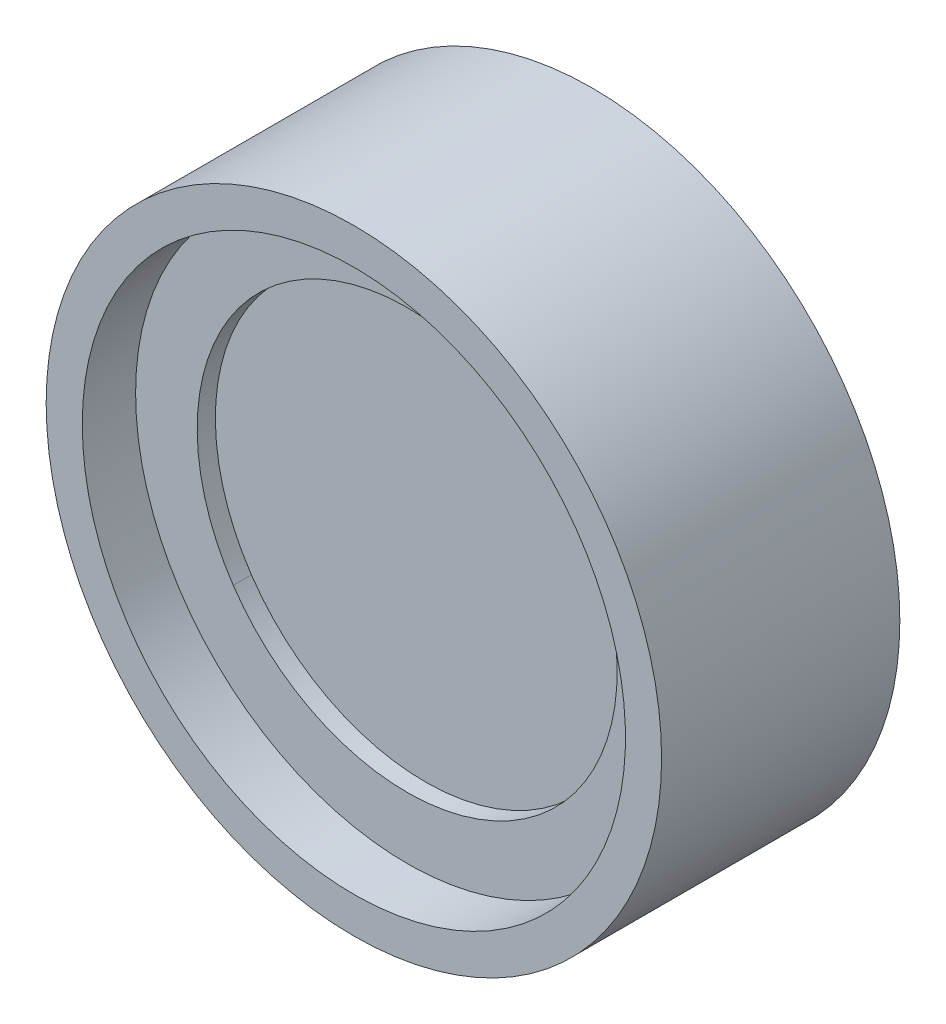
ISO-10303-21;
HEADER;
FILE_DESCRIPTION(('STEP AP214'),'2;1');
FILE_NAME('part.step','',(''),(''),'','','');
FILE_SCHEMA(('AUTOMOTIVE_DESIGN { 1 0 10303 214 1 1 1 1 }'));
ENDSEC;
DATA;
#1=APPLICATION_CONTEXT('core data for automotive mechanical design processes');
#2=APPLICATION_PROTOCOL_DEFINITION('international standard','automotive_design',2000,#1);
#3=PRODUCT_CONTEXT('',#1,'mechanical');
#4=PRODUCT('Part','Part','',(#3));
#5=PRODUCT_RELATED_PRODUCT_CATEGORY('part','',(#4));
#6=PRODUCT_DEFINITION_FORMATION('','',#4);
#7=PRODUCT_DEFINITION_CONTEXT('part definition',#1,'design');
#8=PRODUCT_DEFINITION('design','',#6,#7);
#9=PRODUCT_DEFINITION_SHAPE('','',#8);
#10=(LENGTH_UNIT() NAMED_UNIT(*) SI_UNIT(.MILLI.,.METRE.));
#11=(NAMED_UNIT(*) PLANE_ANGLE_UNIT() SI_UNIT($,.RADIAN.));
#12=(NAMED_UNIT(*) SI_UNIT($,.STERADIAN.) SOLID_ANGLE_UNIT());
#13=UNCERTAINTY_MEASURE_WITH_UNIT(LENGTH_MEASURE(1.E-05),#10,'distance_accuracy_value','');
#14=(GEOMETRIC_REPRESENTATION_CONTEXT(3) GLOBAL_UNCERTAINTY_ASSIGNED_CONTEXT((#13)) GLOBAL_UNIT_ASSIGNED_CONTEXT((#10,
#11,#12)) REPRESENTATION_CONTEXT('',''));
#15=CARTESIAN_POINT('',(0.,0.,0.));
#16=DIRECTION('',(0.,0.,1.));
#17=DIRECTION('',(1.,0.,0.));
#18=AXIS2_PLACEMENT_3D('',#15,#16,#17);
#19=CARTESIAN_POINT('',(-6.,0.,0.381));
#20=DIRECTION('',(0.,0.,1.));
#21=DIRECTION('',(1.,0.,0.));
#22=AXIS2_PLACEMENT_3D('',#19,#20,#21);
#23=PLANE('',#22);
#24=CARTESIAN_POINT('',(0.,0.,0.381));
#25=DIRECTION('',(0.,0.,-1.));
#26=DIRECTION('',(-1.,0.,0.));
#27=AXIS2_PLACEMENT_3D('',#24,#25,#26);
#28=CIRCLE('',#27,5.2);
#29=CARTESIAN_POINT('',(-5.2,0.,0.381));
#30=VERTEX_POINT('',#29);
#31=EDGE_CURVE('P0_E10',#30,#30,#28,.T.);
#32=ORIENTED_EDGE('',*,*,#31,.T.);
#33=EDGE_LOOP('',(#32));
#34=FACE_BOUND('',#33,.T.);
#35=CARTESIAN_POINT('',(0.,0.,0.381));
#36=DIRECTION('',(0.,0.,-1.));
#37=DIRECTION('',(-1.,0.,0.));
#38=AXIS2_PLACEMENT_3D('',#35,#36,#37);
#39=CIRCLE('',#38,6.);
#40=CARTESIAN_POINT('',(-6.,0.,0.381));
#41=VERTEX_POINT('',#40);
#42=EDGE_CURVE('P0_E63',#41,#41,#39,.T.);
#43=ORIENTED_EDGE('',*,*,#42,.F.);
#44=EDGE_LOOP('',(#43));
#45=FACE_BOUND('',#44,.T.);
#46=ADVANCED_FACE('P0_F35',(#34,#45),#23,.T.);
#47=CARTESIAN_POINT('',(0.,0.,-1.69506508729034));
#48=DIRECTION('',(0.,0.,-1.));
#49=DIRECTION('',(-1.,0.,0.));
#50=AXIS2_PLACEMENT_3D('',#47,#48,#49);
#51=CYLINDRICAL_SURFACE('',#50,5.2);
#52=CARTESIAN_POINT('',(0.,0.,-1.119));
#53=DIRECTION('',(0.,0.,-1.));
#54=DIRECTION('',(-1.,0.,0.));
#55=AXIS2_PLACEMENT_3D('',#52,#53,#54);
#56=CIRCLE('',#55,5.2);
#57=CARTESIAN_POINT('',(-5.2,0.,-1.119));
#58=VERTEX_POINT('',#57);
#59=EDGE_CURVE('P0_E41',#58,#58,#56,.T.);
#60=ORIENTED_EDGE('',*,*,#59,.T.);
#61=EDGE_LOOP('',(#60));
#62=FACE_BOUND('',#61,.T.);
#63=ORIENTED_EDGE('',*,*,#31,.F.);
#64=EDGE_LOOP('',(#63));
#65=FACE_BOUND('',#64,.T.);
#66=ADVANCED_FACE('P0_F71',(#62,#65),#51,.F.);
#67=CARTESIAN_POINT('',(-5.2,0.,-1.119));
#68=DIRECTION('',(0.,0.,-1.));
#69=DIRECTION('',(-1.,0.,0.));
#70=AXIS2_PLACEMENT_3D('',#67,#68,#69);
#71=PLANE('',#70);
#72=CARTESIAN_POINT('',(0.,0.,-1.119));
#73=DIRECTION('',(0.,0.,-1.));
#74=DIRECTION('',(-1.,0.,0.));
#75=AXIS2_PLACEMENT_3D('',#72,#73,#74);
#76=CIRCLE('',#75,6.45801585981583);
#77=CARTESIAN_POINT('',(-6.45801585981583,0.,-1.119));
#78=VERTEX_POINT('',#77);
#79=EDGE_CURVE('P0_E45',#78,#78,#76,.T.);
#80=ORIENTED_EDGE('',*,*,#79,.T.);
#81=EDGE_LOOP('',(#80));
#82=FACE_BOUND('',#81,.T.);
#83=ORIENTED_EDGE('',*,*,#59,.F.);
#84=EDGE_LOOP('',(#83));
#85=FACE_BOUND('',#84,.T.);
#86=ADVANCED_FACE('P0_F75',(#82,#85),#71,.T.);
#87=CARTESIAN_POINT('',(0.,0.,-1.69506508729034));
#88=DIRECTION('',(0.,0.,-1.));
#89=DIRECTION('',(-1.,0.,0.));
#90=AXIS2_PLACEMENT_3D('',#87,#88,#89);
#91=CYLINDRICAL_SURFACE('',#90,6.45801585981583);
#92=CARTESIAN_POINT('',(0.,0.,3.881));
#93=DIRECTION('',(0.,0.,-1.));
#94=DIRECTION('',(-1.,0.,0.));
#95=AXIS2_PLACEMENT_3D('',#92,#93,#94);
#96=CIRCLE('',#95,6.45801585981583);
#97=CARTESIAN_POINT('',(-6.45801585981583,0.,3.881));
#98=VERTEX_POINT('',#97);
#99=EDGE_CURVE('P0_E49',#98,#98,#96,.T.);
#100=ORIENTED_EDGE('',*,*,#99,.T.);
#101=EDGE_LOOP('',(#100));
#102=FACE_BOUND('',#101,.T.);
#103=ORIENTED_EDGE('',*,*,#79,.F.);
#104=EDGE_LOOP('',(#103));
#105=FACE_BOUND('',#104,.T.);
#106=ADVANCED_FACE('P0_F79',(#102,#105),#91,.T.);
#107=CARTESIAN_POINT('',(-6.45801585981583,0.,3.881));
#108=DIRECTION('',(0.,0.,1.));
#109=DIRECTION('',(1.,0.,0.));
#110=AXIS2_PLACEMENT_3D('',#107,#108,#109);
#111=PLANE('',#110);
#112=CARTESIAN_POINT('',(0.,0.,3.881));
#113=DIRECTION('',(0.,0.,-1.));
#114=DIRECTION('',(-1.,0.,0.));
#115=AXIS2_PLACEMENT_3D('',#112,#113,#114);
#116=CIRCLE('',#115,5.7);
#117=CARTESIAN_POINT('',(-5.7,0.,3.881));
#118=VERTEX_POINT('',#117);
#119=EDGE_CURVE('P0_E54',#118,#118,#116,.T.);
#120=ORIENTED_EDGE('',*,*,#119,.T.);
#121=EDGE_LOOP('',(#120));
#122=FACE_BOUND('',#121,.T.);
#123=ORIENTED_EDGE('',*,*,#99,.F.);
#124=EDGE_LOOP('',(#123));
#125=FACE_BOUND('',#124,.T.);
#126=ADVANCED_FACE('P0_F86',(#122,#125),#111,.T.);
#127=CARTESIAN_POINT('',(0.,0.,-1.69506508729034));
#128=DIRECTION('',(0.,0.,-1.));
#129=DIRECTION('',(-1.,0.,0.));
#130=AXIS2_PLACEMENT_3D('',#127,#128,#129);
#131=CYLINDRICAL_SURFACE('',#130,5.7);
#132=CARTESIAN_POINT('',(0.,0.,0.881));
#133=DIRECTION('',(0.,0.,-1.));
#134=DIRECTION('',(-1.,0.,0.));
#135=AXIS2_PLACEMENT_3D('',#132,#133,#134);
#136=CIRCLE('',#135,5.7);
#137=CARTESIAN_POINT('',(-5.7,0.,0.881));
#138=VERTEX_POINT('',#137);
#139=EDGE_CURVE('P0_E57',#138,#138,#136,.T.);
#140=ORIENTED_EDGE('',*,*,#139,.T.);
#141=EDGE_LOOP('',(#140));
#142=FACE_BOUND('',#141,.T.);
#143=ORIENTED_EDGE('',*,*,#119,.F.);
#144=EDGE_LOOP('',(#143));
#145=FACE_BOUND('',#144,.T.);
#146=ADVANCED_FACE('P0_F90',(#142,#145),#131,.F.);
#147=CARTESIAN_POINT('',(-5.7,0.,0.881));
#148=DIRECTION('',(0.,0.,-1.));
#149=DIRECTION('',(-1.,0.,0.));
#150=AXIS2_PLACEMENT_3D('',#147,#148,#149);
#151=PLANE('',#150);
#152=CARTESIAN_POINT('',(0.,0.,0.881));
#153=DIRECTION('',(0.,0.,-1.));
#154=DIRECTION('',(-1.,0.,0.));
#155=AXIS2_PLACEMENT_3D('',#152,#153,#154);
#156=CIRCLE('',#155,6.);
#157=CARTESIAN_POINT('',(-6.,0.,0.881));
#158=VERTEX_POINT('',#157);
#159=EDGE_CURVE('P0_E60',#158,#158,#156,.T.);
#160=ORIENTED_EDGE('',*,*,#159,.T.);
#161=EDGE_LOOP('',(#160));
#162=FACE_BOUND('',#161,.T.);
#163=ORIENTED_EDGE('',*,*,#139,.F.);
#164=EDGE_LOOP('',(#163));
#165=FACE_BOUND('',#164,.T.);
#166=ADVANCED_FACE('P0_F94',(#162,#165),#151,.T.);
#167=CARTESIAN_POINT('',(0.,0.,-1.69506508729034));
#168=DIRECTION('',(0.,0.,-1.));
#169=DIRECTION('',(-1.,0.,0.));
#170=AXIS2_PLACEMENT_3D('',#167,#168,#169);
#171=CYLINDRICAL_SURFACE('',#170,6.);
#172=ORIENTED_EDGE('',*,*,#42,.T.);
#173=EDGE_LOOP('',(#172));
#174=FACE_BOUND('',#173,.T.);
#175=ORIENTED_EDGE('',*,*,#159,.F.);
#176=EDGE_LOOP('',(#175));
#177=FACE_BOUND('',#176,.T.);
#178=ADVANCED_FACE('P0_F67',(#174,#177),#171,.F.);
#179=CLOSED_SHELL('',(#46,#66,#86,#106,#126,#146,#166,#178));
#180=MANIFOLD_SOLID_BREP('P0_B2',#179);
#181=CARTESIAN_POINT('',(0.,0.,2.381));
#182=DIRECTION('',(0.,0.,1.));
#183=DIRECTION('',(0.828414208466952,0.560115969429611,0.));
#184=AXIS2_PLACEMENT_3D('',#181,#182,#183);
#185=CYLINDRICAL_SURFACE('',#184,4.4069);
#186=CARTESIAN_POINT('',(0.,0.,2.381));
#187=DIRECTION('',(0.,0.,1.));
#188=DIRECTION('',(0.828414208466952,0.560115969429611,0.));
#189=AXIS2_PLACEMENT_3D('',#186,#187,#188);
#190=CIRCLE('',#189,4.4069);
#191=CARTESIAN_POINT('',(-3.65073857529301,-2.46837506567935,2.381));
#192=VERTEX_POINT('',#191);
#193=CARTESIAN_POINT('',(3.65073857529301,2.46837506567935,2.381));
#194=VERTEX_POINT('',#193);
#195=EDGE_CURVE('P1_E48',#192,#194,#190,.T.);
#196=ORIENTED_EDGE('',*,*,#195,.F.);
#197=DIRECTION('',(0.,0.,1.));
#198=VECTOR('',#197,1.);
#199=CARTESIAN_POINT('',(-3.65073857529301,-2.46837506567935,2.381));
#200=LINE('',#199,#198);
#201=CARTESIAN_POINT('',(-3.65073857529301,-2.46837506567935,2.762));
#202=VERTEX_POINT('',#201);
#203=EDGE_CURVE('P1_E13',#192,#202,#200,.T.);
#204=ORIENTED_EDGE('',*,*,#203,.T.);
#205=CARTESIAN_POINT('',(0.,0.,2.762));
#206=DIRECTION('',(0.,0.,1.));
#207=DIRECTION('',(0.828414208466952,0.560115969429611,0.));
#208=AXIS2_PLACEMENT_3D('',#205,#206,#207);
#209=CIRCLE('',#208,4.4069);
#210=CARTESIAN_POINT('',(3.65073857529301,2.46837506567935,2.762));
#211=VERTEX_POINT('',#210);
#212=EDGE_CURVE('P1_E35',#202,#211,#209,.T.);
#213=ORIENTED_EDGE('',*,*,#212,.T.);
#214=DIRECTION('',(0.,0.,1.));
#215=VECTOR('',#214,1.);
#216=CARTESIAN_POINT('',(3.65073857529301,2.46837506567935,2.381));
#217=LINE('',#216,#215);
#218=EDGE_CURVE('P1_E28',#194,#211,#217,.T.);
#219=ORIENTED_EDGE('',*,*,#218,.F.);
#220=EDGE_LOOP('',(#196,#204,#213,#219));
#221=FACE_BOUND('',#220,.T.);
#222=ADVANCED_FACE('P1_F24',(#221),#185,.F.);
#223=CARTESIAN_POINT('',(0.,0.,2.381));
#224=DIRECTION('',(0.,0.,1.));
#225=DIRECTION('',(0.828414208466952,0.560115969429611,0.));
#226=AXIS2_PLACEMENT_3D('',#223,#224,#225);
#227=CYLINDRICAL_SURFACE('',#226,5.715);
#228=CARTESIAN_POINT('',(0.,0.,2.381));
#229=DIRECTION('',(0.,0.,1.));
#230=DIRECTION('',(0.828414208466952,0.560115969429611,0.));
#231=AXIS2_PLACEMENT_3D('',#228,#229,#230);
#232=CIRCLE('',#231,5.715);
#233=CARTESIAN_POINT('',(4.73438720138863,3.20106276529023,2.381));
#234=VERTEX_POINT('',#233);
#235=CARTESIAN_POINT('',(-4.73438720138863,-3.20106276529023,2.381));
#236=VERTEX_POINT('',#235);
#237=EDGE_CURVE('P1_E86',#234,#236,#232,.T.);
#238=ORIENTED_EDGE('',*,*,#237,.T.);
#239=DIRECTION('',(0.,0.,1.));
#240=VECTOR('',#239,1.);
#241=CARTESIAN_POINT('',(-4.73438720138863,-3.20106276529023,2.381));
#242=LINE('',#241,#240);
#243=CARTESIAN_POINT('',(-4.73438720138863,-3.20106276529023,2.762));
#244=VERTEX_POINT('',#243);
#245=EDGE_CURVE('P1_E99',#236,#244,#242,.T.);
#246=ORIENTED_EDGE('',*,*,#245,.T.);
#247=CARTESIAN_POINT('',(0.,0.,2.762));
#248=DIRECTION('',(0.,0.,1.));
#249=DIRECTION('',(0.828414208466952,0.560115969429611,0.));
#250=AXIS2_PLACEMENT_3D('',#247,#248,#249);
#251=CIRCLE('',#250,5.715);
#252=CARTESIAN_POINT('',(4.73438720138863,3.20106276529023,2.762));
#253=VERTEX_POINT('',#252);
#254=EDGE_CURVE('P1_E77',#253,#244,#251,.T.);
#255=ORIENTED_EDGE('',*,*,#254,.F.);
#256=DIRECTION('',(0.,0.,1.));
#257=VECTOR('',#256,1.);
#258=CARTESIAN_POINT('',(4.73438720138863,3.20106276529023,2.381));
#259=LINE('',#258,#257);
#260=EDGE_CURVE('P1_E83',#234,#253,#259,.T.);
#261=ORIENTED_EDGE('',*,*,#260,.F.);
#262=EDGE_LOOP('',(#238,#246,#255,#261));
#263=FACE_BOUND('',#262,.T.);
#264=ADVANCED_FACE('P1_F85',(#263),#227,.T.);
#265=CARTESIAN_POINT('',(0.,0.,2.381));
#266=DIRECTION('',(0.,0.,1.));
#267=DIRECTION('',(0.828414208466952,0.560115969429611,0.));
#268=AXIS2_PLACEMENT_3D('',#265,#266,#267);
#269=CYLINDRICAL_SURFACE('',#268,5.715);
#270=ORIENTED_EDGE('',*,*,#245,.F.);
#271=CARTESIAN_POINT('',(0.,0.,2.381));
#272=DIRECTION('',(0.,0.,1.));
#273=DIRECTION('',(0.828414208466952,0.560115969429611,0.));
#274=AXIS2_PLACEMENT_3D('',#271,#272,#273);
#275=CIRCLE('',#274,5.715);
#276=EDGE_CURVE('P1_E93',#236,#234,#275,.T.);
#277=ORIENTED_EDGE('',*,*,#276,.T.);
#278=ORIENTED_EDGE('',*,*,#260,.T.);
#279=CARTESIAN_POINT('',(0.,0.,2.762));
#280=DIRECTION('',(0.,0.,1.));
#281=DIRECTION('',(0.828414208466952,0.560115969429611,0.));
#282=AXIS2_PLACEMENT_3D('',#279,#280,#281);
#283=CIRCLE('',#282,5.715);
#284=EDGE_CURVE('P1_E232',#244,#253,#283,.T.);
#285=ORIENTED_EDGE('',*,*,#284,.F.);
#286=EDGE_LOOP('',(#270,#277,#278,#285));
#287=FACE_BOUND('',#286,.T.);
#288=ADVANCED_FACE('P1_F101',(#287),#269,.T.);
#289=CARTESIAN_POINT('',(0.,0.,2.381));
#290=DIRECTION('',(0.,0.,1.));
#291=DIRECTION('',(0.828414208466952,0.560115969429611,0.));
#292=AXIS2_PLACEMENT_3D('',#289,#290,#291);
#293=PLANE('',#292);
#294=ORIENTED_EDGE('',*,*,#237,.F.);
#295=ORIENTED_EDGE('',*,*,#276,.F.);
#296=EDGE_LOOP('',(#294,#295));
#297=FACE_BOUND('',#296,.T.);
#298=CARTESIAN_POINT('',(0.,0.,2.381));
#299=DIRECTION('',(0.,0.,1.));
#300=DIRECTION('',(0.828414208466952,0.560115969429611,0.));
#301=AXIS2_PLACEMENT_3D('',#298,#299,#300);
#302=CIRCLE('',#301,4.4069);
#303=EDGE_CURVE('P1_E94',#194,#192,#302,.T.);
#304=ORIENTED_EDGE('',*,*,#303,.T.);
#305=ORIENTED_EDGE('',*,*,#195,.T.);
#306=EDGE_LOOP('',(#304,#305));
#307=FACE_BOUND('',#306,.T.);
#308=ADVANCED_FACE('P1_F26',(#297,#307),#293,.F.);
#309=CARTESIAN_POINT('',(0.,0.,2.762));
#310=DIRECTION('',(0.,0.,1.));
#311=DIRECTION('',(0.828414208466952,0.560115969429611,0.));
#312=AXIS2_PLACEMENT_3D('',#309,#310,#311);
#313=PLANE('',#312);
#314=ORIENTED_EDGE('',*,*,#254,.T.);
#315=ORIENTED_EDGE('',*,*,#284,.T.);
#316=EDGE_LOOP('',(#314,#315));
#317=FACE_BOUND('',#316,.T.);
#318=CARTESIAN_POINT('',(0.,0.,2.762));
#319=DIRECTION('',(0.,0.,1.));
#320=DIRECTION('',(0.828414208466952,0.560115969429611,0.));
#321=AXIS2_PLACEMENT_3D('',#318,#319,#320);
#322=CIRCLE('',#321,4.4069);
#323=EDGE_CURVE('P1_E115',#211,#202,#322,.T.);
#324=ORIENTED_EDGE('',*,*,#323,.F.);
#325=ORIENTED_EDGE('',*,*,#212,.F.);
#326=EDGE_LOOP('',(#324,#325));
#327=FACE_BOUND('',#326,.T.);
#328=ADVANCED_FACE('P1_F128',(#317,#327),#313,.T.);
#329=CARTESIAN_POINT('',(0.,0.,2.381));
#330=DIRECTION('',(0.,0.,1.));
#331=DIRECTION('',(0.828414208466952,0.560115969429611,0.));
#332=AXIS2_PLACEMENT_3D('',#329,#330,#331);
#333=CYLINDRICAL_SURFACE('',#332,4.4069);
#334=ORIENTED_EDGE('',*,*,#203,.F.);
#335=ORIENTED_EDGE('',*,*,#303,.F.);
#336=ORIENTED_EDGE('',*,*,#218,.T.);
#337=ORIENTED_EDGE('',*,*,#323,.T.);
#338=EDGE_LOOP('',(#334,#335,#336,#337));
#339=FACE_BOUND('',#338,.T.);
#340=ADVANCED_FACE('P1_F125',(#339),#333,.F.);
#341=CLOSED_SHELL('',(#222,#264,#288,#308,#328,#340));
#342=MANIFOLD_SOLID_BREP('P1_B1',#341);
#343=CARTESIAN_POINT('',(0.,0.,2.381));
#344=DIRECTION('',(0.,0.,-1.));
#345=DIRECTION('',(-0.806844709706526,-0.590763585894215,0.));
#346=AXIS2_PLACEMENT_3D('',#343,#344,#345);
#347=CYLINDRICAL_SURFACE('',#346,5.7);
#348=CARTESIAN_POINT('',(0.,0.,2.381));
#349=DIRECTION('',(0.,0.,1.));
#350=DIRECTION('',(0.806844709706526,0.590763585894215,0.));
#351=AXIS2_PLACEMENT_3D('',#348,#349,#350);
#352=CIRCLE('',#351,5.7);
#353=CARTESIAN_POINT('',(4.5990148453272,3.36735243959702,2.381));
#354=VERTEX_POINT('',#353);
#355=CARTESIAN_POINT('',(-4.5990148453272,-3.36735243959702,2.381));
#356=VERTEX_POINT('',#355);
#357=EDGE_CURVE('P2_E47',#354,#356,#352,.T.);
#358=ORIENTED_EDGE('',*,*,#357,.F.);
#359=DIRECTION('',(0.,0.,-1.));
#360=VECTOR('',#359,1.);
#361=CARTESIAN_POINT('',(4.5990148453272,3.36735243959702,2.381));
#362=LINE('',#361,#360);
#363=CARTESIAN_POINT('',(4.5990148453272,3.36735243959702,0.381));
#364=VERTEX_POINT('',#363);
#365=EDGE_CURVE('P2_E13',#354,#364,#362,.T.);
#366=ORIENTED_EDGE('',*,*,#365,.T.);
#367=CARTESIAN_POINT('',(0.,0.,0.381));
#368=DIRECTION('',(0.,0.,1.));
#369=DIRECTION('',(0.806844709706526,0.590763585894215,0.));
#370=AXIS2_PLACEMENT_3D('',#367,#368,#369);
#371=CIRCLE('',#370,5.7);
#372=CARTESIAN_POINT('',(-4.5990148453272,-3.36735243959702,0.381));
#373=VERTEX_POINT('',#372);
#374=EDGE_CURVE('P2_E34',#364,#373,#371,.T.);
#375=ORIENTED_EDGE('',*,*,#374,.T.);
#376=DIRECTION('',(0.,0.,-1.));
#377=VECTOR('',#376,1.);
#378=CARTESIAN_POINT('',(-4.5990148453272,-3.36735243959702,2.381));
#379=LINE('',#378,#377);
#380=EDGE_CURVE('P2_E65',#356,#373,#379,.T.);
#381=ORIENTED_EDGE('',*,*,#380,.F.);
#382=EDGE_LOOP('',(#358,#366,#375,#381));
#383=FACE_BOUND('',#382,.T.);
#384=ADVANCED_FACE('P2_F24',(#383),#347,.T.);
#385=CARTESIAN_POINT('',(0.,0.,2.381));
#386=DIRECTION('',(0.,0.,-1.));
#387=DIRECTION('',(-0.806844709706526,-0.590763585894215,0.));
#388=AXIS2_PLACEMENT_3D('',#385,#386,#387);
#389=CYLINDRICAL_SURFACE('',#388,5.7);
#390=ORIENTED_EDGE('',*,*,#365,.F.);
#391=CARTESIAN_POINT('',(0.,0.,2.381));
#392=DIRECTION('',(0.,0.,1.));
#393=DIRECTION('',(0.806844709706526,0.590763585894215,0.));
#394=AXIS2_PLACEMENT_3D('',#391,#392,#393);
#395=CIRCLE('',#394,5.7);
#396=EDGE_CURVE('P2_E69',#356,#354,#395,.T.);
#397=ORIENTED_EDGE('',*,*,#396,.F.);
#398=ORIENTED_EDGE('',*,*,#380,.T.);
#399=CARTESIAN_POINT('',(0.,0.,0.381));
#400=DIRECTION('',(0.,0.,1.));
#401=DIRECTION('',(0.806844709706526,0.590763585894215,0.));
#402=AXIS2_PLACEMENT_3D('',#399,#400,#401);
#403=CIRCLE('',#402,5.7);
#404=EDGE_CURVE('P2_E27',#373,#364,#403,.T.);
#405=ORIENTED_EDGE('',*,*,#404,.T.);
#406=EDGE_LOOP('',(#390,#397,#398,#405));
#407=FACE_BOUND('',#406,.T.);
#408=ADVANCED_FACE('P2_F67',(#407),#389,.T.);
#409=CARTESIAN_POINT('',(0.,0.,2.381));
#410=DIRECTION('',(0.,0.,1.));
#411=DIRECTION('',(0.806844709706526,0.590763585894215,0.));
#412=AXIS2_PLACEMENT_3D('',#409,#410,#411);
#413=PLANE('',#412);
#414=ORIENTED_EDGE('',*,*,#396,.T.);
#415=ORIENTED_EDGE('',*,*,#357,.T.);
#416=EDGE_LOOP('',(#414,#415));
#417=FACE_BOUND('',#416,.T.);
#418=ADVANCED_FACE('P2_F105',(#417),#413,.T.);
#419=CARTESIAN_POINT('',(0.,0.,0.381));
#420=DIRECTION('',(0.,0.,1.));
#421=DIRECTION('',(0.806844709706526,0.590763585894215,0.));
#422=AXIS2_PLACEMENT_3D('',#419,#420,#421);
#423=PLANE('',#422);
#424=ORIENTED_EDGE('',*,*,#404,.F.);
#425=ORIENTED_EDGE('',*,*,#374,.F.);
#426=EDGE_LOOP('',(#424,#425));
#427=FACE_BOUND('',#426,.T.);
#428=ADVANCED_FACE('P2_F75',(#427),#423,.F.);
#429=CLOSED_SHELL('',(#384,#408,#418,#428));
#430=MANIFOLD_SOLID_BREP('P2_B1',#429);
#431=ADVANCED_BREP_SHAPE_REPRESENTATION('',(#18,#180,#342,#430),#14);
#432=SHAPE_DEFINITION_REPRESENTATION(#9,#431);
ENDSEC;
END-ISO-10303-21;
